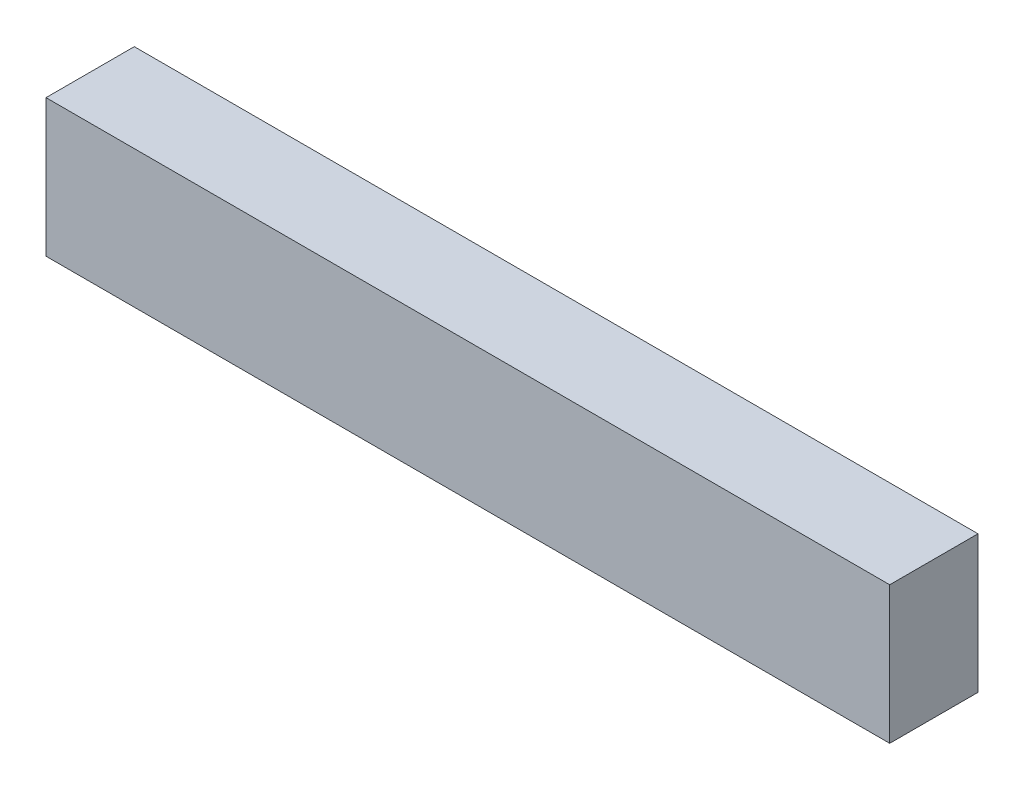
ISO-10303-21;
HEADER;
FILE_DESCRIPTION(('STEP AP214'),'2;1');
FILE_NAME('part.step','',(''),(''),'','','');
FILE_SCHEMA(('AUTOMOTIVE_DESIGN { 1 0 10303 214 1 1 1 1 }'));
ENDSEC;
DATA;
#1=APPLICATION_CONTEXT('core data for automotive mechanical design processes');
#2=APPLICATION_PROTOCOL_DEFINITION('international standard','automotive_design',2000,#1);
#3=PRODUCT_CONTEXT('',#1,'mechanical');
#4=PRODUCT('Part','Part','',(#3));
#5=PRODUCT_RELATED_PRODUCT_CATEGORY('part','',(#4));
#6=PRODUCT_DEFINITION_FORMATION('','',#4);
#7=PRODUCT_DEFINITION_CONTEXT('part definition',#1,'design');
#8=PRODUCT_DEFINITION('design','',#6,#7);
#9=PRODUCT_DEFINITION_SHAPE('','',#8);
#10=(LENGTH_UNIT() NAMED_UNIT(*) SI_UNIT(.MILLI.,.METRE.));
#11=(NAMED_UNIT(*) PLANE_ANGLE_UNIT() SI_UNIT($,.RADIAN.));
#12=(NAMED_UNIT(*) SI_UNIT($,.STERADIAN.) SOLID_ANGLE_UNIT());
#13=UNCERTAINTY_MEASURE_WITH_UNIT(LENGTH_MEASURE(1.E-05),#10,'distance_accuracy_value','');
#14=(GEOMETRIC_REPRESENTATION_CONTEXT(3) GLOBAL_UNCERTAINTY_ASSIGNED_CONTEXT((#13)) GLOBAL_UNIT_ASSIGNED_CONTEXT((#10,
#11,#12)) REPRESENTATION_CONTEXT('',''));
#15=CARTESIAN_POINT('',(0.,0.,0.));
#16=DIRECTION('',(0.,0.,1.));
#17=DIRECTION('',(1.,0.,0.));
#18=AXIS2_PLACEMENT_3D('',#15,#16,#17);
#19=CARTESIAN_POINT('',(-2.14999824,-0.3499993,0.4499991));
#20=DIRECTION('',(0.,0.,1.));
#21=DIRECTION('',(1.,0.,0.));
#22=AXIS2_PLACEMENT_3D('',#19,#20,#21);
#23=PLANE('',#22);
#24=DIRECTION('',(1.,0.,0.));
#25=VECTOR('',#24,1.);
#26=CARTESIAN_POINT('',(-2.14999824,0.35000184,0.4499991));
#27=LINE('',#26,#25);
#28=CARTESIAN_POINT('',(-2.14999824,0.35000184,0.4499991));
#29=VERTEX_POINT('',#28);
#30=CARTESIAN_POINT('',(2.15000078,0.35000184,0.4499991));
#31=VERTEX_POINT('',#30);
#32=EDGE_CURVE('E53',#29,#31,#27,.T.);
#33=ORIENTED_EDGE('',*,*,#32,.F.);
#34=DIRECTION('',(0.,1.,0.));
#35=VECTOR('',#34,1.);
#36=CARTESIAN_POINT('',(-2.14999824,-0.3499993,0.4499991));
#37=LINE('',#36,#35);
#38=CARTESIAN_POINT('',(-2.14999824,-0.3499993,0.4499991));
#39=VERTEX_POINT('',#38);
#40=EDGE_CURVE('E20',#29,#39,#37,.F.);
#41=ORIENTED_EDGE('',*,*,#40,.T.);
#42=DIRECTION('',(1.,0.,0.));
#43=VECTOR('',#42,1.);
#44=CARTESIAN_POINT('',(2.15000078,-0.3499993,0.4499991));
#45=LINE('',#44,#43);
#46=CARTESIAN_POINT('',(2.15000078,-0.3499993,0.4499991));
#47=VERTEX_POINT('',#46);
#48=EDGE_CURVE('E67',#47,#39,#45,.F.);
#49=ORIENTED_EDGE('',*,*,#48,.F.);
#50=DIRECTION('',(0.,1.,0.));
#51=VECTOR('',#50,1.);
#52=CARTESIAN_POINT('',(2.15000078,0.35000184,0.4499991));
#53=LINE('',#52,#51);
#54=EDGE_CURVE('E58',#31,#47,#53,.F.);
#55=ORIENTED_EDGE('',*,*,#54,.F.);
#56=EDGE_LOOP('',(#33,#41,#49,#55));
#57=FACE_BOUND('',#56,.T.);
#58=ADVANCED_FACE('F17',(#57),#23,.T.);
#59=CARTESIAN_POINT('',(2.15000078,-0.3499993,0.));
#60=DIRECTION('',(0.,-1.,0.));
#61=DIRECTION('',(0.,0.,-1.));
#62=AXIS2_PLACEMENT_3D('',#59,#60,#61);
#63=PLANE('',#62);
#64=DIRECTION('',(0.,0.,1.));
#65=VECTOR('',#64,1.);
#66=CARTESIAN_POINT('',(-2.14999824,-0.3499993,0.));
#67=LINE('',#66,#65);
#68=CARTESIAN_POINT('',(-2.14999824,-0.3499993,0.));
#69=VERTEX_POINT('',#68);
#70=EDGE_CURVE('E80',#69,#39,#67,.T.);
#71=ORIENTED_EDGE('',*,*,#70,.F.);
#72=DIRECTION('',(1.,0.,0.));
#73=VECTOR('',#72,1.);
#74=CARTESIAN_POINT('',(-2.14999824,-0.3499993,0.));
#75=LINE('',#74,#73);
#76=CARTESIAN_POINT('',(2.15000078,-0.3499993,0.));
#77=VERTEX_POINT('',#76);
#78=EDGE_CURVE('E75',#69,#77,#75,.T.);
#79=ORIENTED_EDGE('',*,*,#78,.T.);
#80=DIRECTION('',(0.,0.,-1.));
#81=VECTOR('',#80,1.);
#82=CARTESIAN_POINT('',(2.15000078,-0.3499993,0.));
#83=LINE('',#82,#81);
#84=EDGE_CURVE('E63',#47,#77,#83,.T.);
#85=ORIENTED_EDGE('',*,*,#84,.F.);
#86=ORIENTED_EDGE('',*,*,#48,.T.);
#87=EDGE_LOOP('',(#71,#79,#85,#86));
#88=FACE_BOUND('',#87,.T.);
#89=ADVANCED_FACE('F74',(#88),#63,.T.);
#90=CARTESIAN_POINT('',(2.15000078,0.35000184,0.));
#91=DIRECTION('',(1.,0.,0.));
#92=DIRECTION('',(0.,0.,-1.));
#93=AXIS2_PLACEMENT_3D('',#90,#91,#92);
#94=PLANE('',#93);
#95=ORIENTED_EDGE('',*,*,#84,.T.);
#96=DIRECTION('',(0.,1.,0.));
#97=VECTOR('',#96,1.);
#98=CARTESIAN_POINT('',(2.15000078,-0.3499993,0.));
#99=LINE('',#98,#97);
#100=CARTESIAN_POINT('',(2.15000078,0.35000184,0.));
#101=VERTEX_POINT('',#100);
#102=EDGE_CURVE('E84',#77,#101,#99,.T.);
#103=ORIENTED_EDGE('',*,*,#102,.T.);
#104=DIRECTION('',(0.,0.,1.));
#105=VECTOR('',#104,1.);
#106=CARTESIAN_POINT('',(2.15000078,0.35000184,0.));
#107=LINE('',#106,#105);
#108=EDGE_CURVE('E65',#31,#101,#107,.F.);
#109=ORIENTED_EDGE('',*,*,#108,.F.);
#110=ORIENTED_EDGE('',*,*,#54,.T.);
#111=EDGE_LOOP('',(#95,#103,#109,#110));
#112=FACE_BOUND('',#111,.T.);
#113=ADVANCED_FACE('F60',(#112),#94,.T.);
#114=CARTESIAN_POINT('',(-2.14999824,0.35000184,0.));
#115=DIRECTION('',(0.,1.,0.));
#116=DIRECTION('',(0.,0.,1.));
#117=AXIS2_PLACEMENT_3D('',#114,#115,#116);
#118=PLANE('',#117);
#119=ORIENTED_EDGE('',*,*,#108,.T.);
#120=DIRECTION('',(1.,0.,0.));
#121=VECTOR('',#120,1.);
#122=CARTESIAN_POINT('',(-2.14999824,0.35000184,0.));
#123=LINE('',#122,#121);
#124=CARTESIAN_POINT('',(-2.14999824,0.35000184,0.));
#125=VERTEX_POINT('',#124);
#126=EDGE_CURVE('E26',#101,#125,#123,.F.);
#127=ORIENTED_EDGE('',*,*,#126,.T.);
#128=DIRECTION('',(0.,0.,1.));
#129=VECTOR('',#128,1.);
#130=CARTESIAN_POINT('',(-2.14999824,0.35000184,0.));
#131=LINE('',#130,#129);
#132=EDGE_CURVE('E34',#29,#125,#131,.F.);
#133=ORIENTED_EDGE('',*,*,#132,.F.);
#134=ORIENTED_EDGE('',*,*,#32,.T.);
#135=EDGE_LOOP('',(#119,#127,#133,#134));
#136=FACE_BOUND('',#135,.T.);
#137=ADVANCED_FACE('F88',(#136),#118,.T.);
#138=CARTESIAN_POINT('',(-2.14999824,-0.3499993,0.));
#139=DIRECTION('',(-1.,0.,0.));
#140=DIRECTION('',(0.,0.,1.));
#141=AXIS2_PLACEMENT_3D('',#138,#139,#140);
#142=PLANE('',#141);
#143=ORIENTED_EDGE('',*,*,#132,.T.);
#144=DIRECTION('',(0.,1.,0.));
#145=VECTOR('',#144,1.);
#146=CARTESIAN_POINT('',(-2.14999824,-0.3499993,0.));
#147=LINE('',#146,#145);
#148=EDGE_CURVE('E11',#125,#69,#147,.F.);
#149=ORIENTED_EDGE('',*,*,#148,.T.);
#150=ORIENTED_EDGE('',*,*,#70,.T.);
#151=ORIENTED_EDGE('',*,*,#40,.F.);
#152=EDGE_LOOP('',(#143,#149,#150,#151));
#153=FACE_BOUND('',#152,.T.);
#154=ADVANCED_FACE('F91',(#153),#142,.T.);
#155=CARTESIAN_POINT('',(-2.14999824,-0.3499993,0.));
#156=DIRECTION('',(0.,0.,1.));
#157=DIRECTION('',(1.,0.,0.));
#158=AXIS2_PLACEMENT_3D('',#155,#156,#157);
#159=PLANE('',#158);
#160=ORIENTED_EDGE('',*,*,#126,.F.);
#161=ORIENTED_EDGE('',*,*,#102,.F.);
#162=ORIENTED_EDGE('',*,*,#78,.F.);
#163=ORIENTED_EDGE('',*,*,#148,.F.);
#164=EDGE_LOOP('',(#160,#161,#162,#163));
#165=FACE_BOUND('',#164,.T.);
#166=ADVANCED_FACE('F90',(#165),#159,.F.);
#167=CLOSED_SHELL('',(#58,#89,#113,#137,#154,#166));
#168=MANIFOLD_SOLID_BREP('B1',#167);
#169=ADVANCED_BREP_SHAPE_REPRESENTATION('',(#18,#168),#14);
#170=SHAPE_DEFINITION_REPRESENTATION(#9,#169);
ENDSEC;
END-ISO-10303-21;
